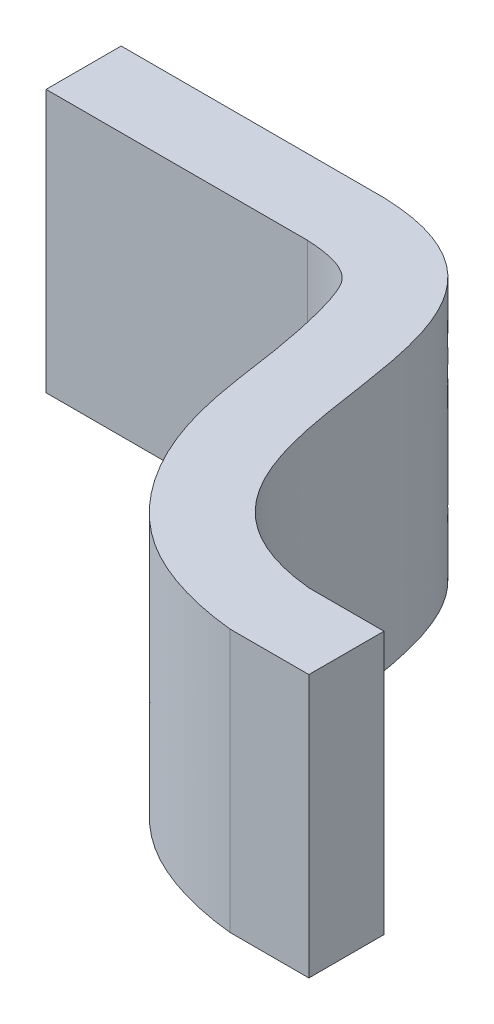
ISO-10303-21;
HEADER;
FILE_DESCRIPTION(('STEP AP214'),'2;1');
FILE_NAME('part.step','',(''),(''),'','','');
FILE_SCHEMA(('AUTOMOTIVE_DESIGN { 1 0 10303 214 1 1 1 1 }'));
ENDSEC;
DATA;
#1=APPLICATION_CONTEXT('core data for automotive mechanical design processes');
#2=APPLICATION_PROTOCOL_DEFINITION('international standard','automotive_design',2000,#1);
#3=PRODUCT_CONTEXT('',#1,'mechanical');
#4=PRODUCT('Part','Part','',(#3));
#5=PRODUCT_RELATED_PRODUCT_CATEGORY('part','',(#4));
#6=PRODUCT_DEFINITION_FORMATION('','',#4);
#7=PRODUCT_DEFINITION_CONTEXT('part definition',#1,'design');
#8=PRODUCT_DEFINITION('design','',#6,#7);
#9=PRODUCT_DEFINITION_SHAPE('','',#8);
#10=(LENGTH_UNIT() NAMED_UNIT(*) SI_UNIT(.MILLI.,.METRE.));
#11=(NAMED_UNIT(*) PLANE_ANGLE_UNIT() SI_UNIT($,.RADIAN.));
#12=(NAMED_UNIT(*) SI_UNIT($,.STERADIAN.) SOLID_ANGLE_UNIT());
#13=UNCERTAINTY_MEASURE_WITH_UNIT(LENGTH_MEASURE(1.E-05),#10,'distance_accuracy_value','');
#14=(GEOMETRIC_REPRESENTATION_CONTEXT(3) GLOBAL_UNCERTAINTY_ASSIGNED_CONTEXT((#13)) GLOBAL_UNIT_ASSIGNED_CONTEXT((#10,
#11,#12)) REPRESENTATION_CONTEXT('',''));
#15=CARTESIAN_POINT('',(0.,0.,0.));
#16=DIRECTION('',(0.,0.,1.));
#17=DIRECTION('',(1.,0.,0.));
#18=AXIS2_PLACEMENT_3D('',#15,#16,#17);
#19=CARTESIAN_POINT('',(0.381074398756027,0.523099170325608,1.2000000284124));
#20=DIRECTION('',(0.,-1.,-4.37113882867379E-08));
#21=DIRECTION('',(1.,0.,0.));
#22=AXIS2_PLACEMENT_3D('',#19,#20,#21);
#23=PLANE('',#22);
#24=CARTESIAN_POINT('',(-6.65392560124397,0.523099179067886,1.0000000284124));
#25=CARTESIAN_POINT('',(-6.6760213847098,0.52309917916311,0.997821538224355));
#26=CARTESIAN_POINT('',(-6.69813368756548,0.5230991793072,0.994525167165358));
#27=CARTESIAN_POINT('',(-6.74194760453987,0.523099179724687,0.984974174651608));
#28=CARTESIAN_POINT('',(-6.76364199343851,0.523099179999495,0.978687308291629));
#29=CARTESIAN_POINT('',(-6.8010868913745,0.523099180632001,0.964217236749238));
#30=CARTESIAN_POINT('',(-6.81710358266756,0.523099180958652,0.956744332526838));
#31=CARTESIAN_POINT('',(-6.84769864594612,0.523099181716968,0.939396085829369));
#32=CARTESIAN_POINT('',(-6.86228342605002,0.523099182148133,0.929532203397508));
#33=CARTESIAN_POINT('',(-6.88912475678651,0.523099183095543,0.907857995547797));
#34=CARTESIAN_POINT('',(-6.90144309560176,0.52309918360844,0.896124255535485));
#35=CARTESIAN_POINT('',(-6.92409093426443,0.523099184713152,0.870851377040496));
#36=CARTESIAN_POINT('',(-6.93441702178863,0.523099185305099,0.857309207032076));
#37=CARTESIAN_POINT('',(-6.96671116783855,0.523099187451881,0.808196568837449));
#38=CARTESIAN_POINT('',(-6.98363339651492,0.523099189149412,0.769361583704008));
#39=CARTESIAN_POINT('',(-7.00636675343762,0.52309919217834,0.700067795532774));
#40=CARTESIAN_POINT('',(-7.01392037587508,0.52309919349072,0.670044046614715));
#41=CARTESIAN_POINT('',(-7.02679822502435,0.523099196138999,0.609458466123203));
#42=CARTESIAN_POINT('',(-7.03211866901882,0.523099197474935,0.57889581220654));
#43=CARTESIAN_POINT('',(-7.04522373011164,0.523099201053773,0.497021526470976));
#44=CARTESIAN_POINT('',(-7.05225323067938,0.523099203301275,0.445604703624301));
#45=CARTESIAN_POINT('',(-7.06582589653957,0.523099206650856,0.368975220682632));
#46=CARTESIAN_POINT('',(-7.07085237182357,0.523099207763354,0.343524254211091));
#47=CARTESIAN_POINT('',(-7.08288891244714,0.523099209966576,0.293120376456015));
#48=CARTESIAN_POINT('',(-7.0898957194452,0.523099211057334,0.2681667185286));
#49=CARTESIAN_POINT('',(-7.10753002382366,0.523099213238403,0.218269668597796));
#50=CARTESIAN_POINT('',(-7.11829723428463,0.523099214326772,0.193370728858562));
#51=CARTESIAN_POINT('',(-7.13813270077437,0.523099215864952,0.158181288876764));
#52=CARTESIAN_POINT('',(-7.14532993400949,0.523099216360521,0.146843995173798));
#53=CARTESIAN_POINT('',(-7.16104748346313,0.523099217309469,0.125134581067309));
#54=CARTESIAN_POINT('',(-7.1695665343253,0.523099217762888,0.114761552617267));
#55=CARTESIAN_POINT('',(-7.19090199977994,0.523099218753559,0.0920976354280377));
#56=CARTESIAN_POINT('',(-7.20421803422598,0.523099219270646,0.0802680737363711));
#57=CARTESIAN_POINT('',(-7.23279289498044,0.523099220190851,0.0592162571948195));
#58=CARTESIAN_POINT('',(-7.24805496936829,0.523099220593773,0.0499984463761796));
#59=CARTESIAN_POINT('',(-7.28054440722777,0.523099221298688,0.033871863666304));
#60=CARTESIAN_POINT('',(-7.29782779482495,0.52309922159565,0.0270781840761291));
#61=CARTESIAN_POINT('',(-7.33319650573112,0.52309922208002,0.0159971017986491));
#62=CARTESIAN_POINT('',(-7.35128360657443,0.523099222267171,0.0117155856600657));
#63=CARTESIAN_POINT('',(-7.38352182929289,0.523099222518294,0.00597054024637886));
#64=CARTESIAN_POINT('',(-7.39760256337062,0.523099222600852,0.00408185602134143));
#65=CARTESIAN_POINT('',(-7.4257638425411,0.523099222721101,0.00133086562621593));
#66=CARTESIAN_POINT('',(-7.43984365839325,0.523099222759113,0.000461264208408363));
#67=CARTESIAN_POINT('',(-7.45392560124401,0.523099222779274,2.84124012060042E-08));
#68=B_SPLINE_CURVE_WITH_KNOTS('',3,(#24,#25,#26,#27,#28,#29,#30,#31,#32,#33,#34,#35,#36,#37,#38,
#39,#40,#41,#42,#43,#44,#45,#46,#47,#48,#49,#50,#51,#52,#53,#54,#55,#56,#57,#58,#59,#60,#61,#62,
#63,#64,#65,#66,#67),.UNSPECIFIED.,.F.,.F.,(4,2,2,2,2,2,2,2,2,2,2,2,2,2,2,2,2,2,2,2,2,4),(0.,
0.0667821137090893,0.134301214684031,0.187128508823994,0.239707439757743,0.290518731452934,
0.341416294675061,0.466712259088971,0.559563019654509,0.652570428897922,0.808245450373596,
0.886023921415196,0.963675157190788,1.04458784966541,1.08478909463837,1.12495209032638,
1.17807587168457,1.2312895104201,1.28677003517691,1.34238004906255,1.38496468867345,
1.42724258099923),.UNSPECIFIED.);
#69=CARTESIAN_POINT('',(-6.65392560124397,0.523099179067886,1.0000000284124));
#70=VERTEX_POINT('',#69);
#71=CARTESIAN_POINT('',(-7.45392560124397,0.523099222779274,2.84124023863797E-08));
#72=VERTEX_POINT('',#71);
#73=EDGE_CURVE('E11',#70,#72,#68,.T.);
#74=ORIENTED_EDGE('',*,*,#73,.F.);
#75=DIRECTION('',(-1.,0.,0.));
#76=VECTOR('',#75,1.);
#77=CARTESIAN_POINT('',(-6.45392560124397,0.523099179067886,1.0000000284124));
#78=LINE('',#77,#76);
#79=CARTESIAN_POINT('',(-6.45392560124397,0.523099179067886,1.0000000284124));
#80=VERTEX_POINT('',#79);
#81=EDGE_CURVE('E179',#80,#70,#78,.T.);
#82=ORIENTED_EDGE('',*,*,#81,.F.);
#83=DIRECTION('',(0.,4.37113883977602E-08,-0.999999999999999));
#84=VECTOR('',#83,1.);
#85=CARTESIAN_POINT('',(-6.45392560124397,0.523099170325608,1.2000000284124));
#86=LINE('',#85,#84);
#87=CARTESIAN_POINT('',(-6.45392560124397,0.523099170325608,1.2000000284124));
#88=VERTEX_POINT('',#87);
#89=EDGE_CURVE('E155',#88,#80,#86,.T.);
#90=ORIENTED_EDGE('',*,*,#89,.F.);
#91=DIRECTION('',(-1.,0.,0.));
#92=VECTOR('',#91,1.);
#93=CARTESIAN_POINT('',(-6.45392560124397,0.523099170325608,1.2000000284124));
#94=LINE('',#93,#92);
#95=CARTESIAN_POINT('',(-6.66372477809197,0.523099170325608,1.2000000284124));
#96=VERTEX_POINT('',#95);
#97=EDGE_CURVE('E148',#88,#96,#94,.T.);
#98=ORIENTED_EDGE('',*,*,#97,.T.);
#99=CARTESIAN_POINT('',(-6.66372477809197,0.523099170325608,1.2000000284124));
#100=CARTESIAN_POINT('',(-6.68235816480651,0.523099170406118,1.19815817509081));
#101=CARTESIAN_POINT('',(-6.70093498946342,0.523099170513507,1.19570139866285));
#102=CARTESIAN_POINT('',(-6.73791221278168,0.52309917078471,1.18949699907566));
#103=CARTESIAN_POINT('',(-6.75631214417819,0.523099170948645,1.1857466015809));
#104=CARTESIAN_POINT('',(-6.79295513620438,0.52309917133702,1.17686162524785));
#105=CARTESIAN_POINT('',(-6.8111952940445,0.523099171561991,1.17171489105382));
#106=CARTESIAN_POINT('',(-6.84717172345389,0.52309917207712,1.15993009834338));
#107=CARTESIAN_POINT('',(-6.86490837899947,0.523099172367228,1.15329321263317));
#108=CARTESIAN_POINT('',(-6.90549462665057,0.523099173130766,1.13582549945528));
#109=CARTESIAN_POINT('',(-6.92807290255751,0.523099173633063,1.12433429434548));
#110=CARTESIAN_POINT('',(-6.97096829666688,0.523099174789194,1.0978850742192));
#111=CARTESIAN_POINT('',(-6.9912955036889,0.523099175442309,1.082943537511));
#112=CARTESIAN_POINT('',(-7.02796037846709,0.523099176815502,1.05152854045932));
#113=CARTESIAN_POINT('',(-7.04448684621663,0.523099177526106,1.03527184444206));
#114=CARTESIAN_POINT('',(-7.0754212602201,0.523099179033289,1.00079152577337));
#115=CARTESIAN_POINT('',(-7.08982362168071,0.523099179830086,0.982562928971802));
#116=CARTESIAN_POINT('',(-7.11808537102814,0.52309918158959,0.942310147448806));
#117=CARTESIAN_POINT('',(-7.1316696505039,0.523099182560717,0.920093360969633));
#118=CARTESIAN_POINT('',(-7.15605550233222,0.523099184565506,0.874229145825882));
#119=CARTESIAN_POINT('',(-7.16686079670802,0.523099185599082,0.850583683658809));
#120=CARTESIAN_POINT('',(-7.18656671922941,0.523099187799275,0.800249155192402));
#121=CARTESIAN_POINT('',(-7.19523524065514,0.523099188969817,0.773470263913924));
#122=CARTESIAN_POINT('',(-7.20995546192352,0.523099191342175,0.719197008038475));
#123=CARTESIAN_POINT('',(-7.21600397870321,0.523099192544028,0.691701815934891));
#124=CARTESIAN_POINT('',(-7.22444466903982,0.523099194510307,0.646718611183905));
#125=CARTESIAN_POINT('',(-7.22735928328766,0.52309919527076,0.629321471969463));
#126=CARTESIAN_POINT('',(-7.23280873084802,0.523099196794382,0.594465063705472));
#127=CARTESIAN_POINT('',(-7.235343477908,0.523099197557551,0.577005781464265));
#128=CARTESIAN_POINT('',(-7.24043139259136,0.523099199083645,0.542092834268316));
#129=CARTESIAN_POINT('',(-7.24298455656837,0.523099199846569,0.524639168879595));
#130=CARTESIAN_POINT('',(-7.24852784389109,0.523099201369191,0.489805623245772));
#131=CARTESIAN_POINT('',(-7.25151784908981,0.52309920212889,0.472425724353722));
#132=CARTESIAN_POINT('',(-7.2593930344497,0.523099203982638,0.430016914878112));
#133=CARTESIAN_POINT('',(-7.26452884999095,0.523099205074757,0.405032186661607));
#134=CARTESIAN_POINT('',(-7.27334542318719,0.523099206701662,0.367812909831134));
#135=CARTESIAN_POINT('',(-7.27647049737492,0.523099207242192,0.355446989187103));
#136=CARTESIAN_POINT('',(-7.28323298853228,0.52309920831701,0.330858098256283));
#137=CARTESIAN_POINT('',(-7.28687011761276,0.523099208851302,0.318635051795952));
#138=CARTESIAN_POINT('',(-7.29334407740757,0.523099209693244,0.299373396061492));
#139=CARTESIAN_POINT('',(-7.2959066269859,0.523099210004872,0.292243982290239));
#140=CARTESIAN_POINT('',(-7.30148473904446,0.523099210620009,0.278171894198803));
#141=CARTESIAN_POINT('',(-7.30449961539945,0.523099210923528,0.27122895550911));
#142=CARTESIAN_POINT('',(-7.31076754414832,0.52309921145799,0.258999943257013));
#143=CARTESIAN_POINT('',(-7.31387365469767,0.523099211691979,0.253644766573164));
#144=CARTESIAN_POINT('',(-7.32080381678023,0.523099212099995,0.244316025576674));
#145=CARTESIAN_POINT('',(-7.32450000384901,0.523099212277838,0.240254004796936));
#146=CARTESIAN_POINT('',(-7.33394897363332,0.523099212634285,0.232075994627863));
#147=CARTESIAN_POINT('',(-7.33998642044214,0.523099212797349,0.22830408040006));
#148=CARTESIAN_POINT('',(-7.34920308092036,0.523099213026277,0.223113120130131));
#149=CARTESIAN_POINT('',(-7.35228960650534,0.523099213099717,0.221466188737754));
#150=CARTESIAN_POINT('',(-7.35857989092758,0.523099213230914,0.218417400174966));
#151=CARTESIAN_POINT('',(-7.36178332741555,0.523099213288711,0.217014922844269));
#152=CARTESIAN_POINT('',(-7.37090352258754,0.52309921343868,0.213465070828703));
#153=CARTESIAN_POINT('',(-7.37693693346537,0.52309921352127,0.211621727693837));
#154=CARTESIAN_POINT('',(-7.38670569686491,0.523099213634643,0.209137235761761));
#155=CARTESIAN_POINT('',(-7.39039887638499,0.523099213672957,0.208309721491273));
#156=CARTESIAN_POINT('',(-7.39781445722382,0.523099213740585,0.20679968656988));
#157=CARTESIAN_POINT('',(-7.40153685423347,0.5230992137699,0.206117144939588));
#158=CARTESIAN_POINT('',(-7.41389968086125,0.523099213860073,0.204032104639086));
#159=CARTESIAN_POINT('',(-7.42257948480063,0.523099213911798,0.202861138742713));
#160=CARTESIAN_POINT('',(-7.43563044947402,0.52309921397252,0.201476623687637));
#161=CARTESIAN_POINT('',(-7.43998307619468,0.523099213989943,0.201077249866301));
#162=CARTESIAN_POINT('',(-7.44869872182374,0.523099214018429,0.200424019159067));
#163=CARTESIAN_POINT('',(-7.45306173976726,0.523099214029493,0.200170149253583));
#164=CARTESIAN_POINT('',(-7.45742938297997,0.523099214036996,0.200000028412402));
#165=B_SPLINE_CURVE_WITH_KNOTS('',3,(#99,#100,#101,#102,#103,#104,#105,#106,#107,#108,#109,#110,
#111,#112,#113,#114,#115,#116,#117,#118,#119,#120,#121,#122,#123,#124,#125,#126,#127,#128,#129,
#130,#131,#132,#133,#134,#135,#136,#137,#138,#139,#140,#141,#142,#143,#144,#145,#146,#147,#148,
#149,#150,#151,#152,#153,#154,#155,#156,#157,#158,#159,#160,#161,#162,#163,#164),.UNSPECIFIED.,
.F.,.F.,(4,2,2,2,2,2,2,2,2,2,2,2,2,2,2,2,2,2,2,2,2,2,2,2,2,2,2,2,2,2,2,2,4),(0.,
0.0561681589095711,0.112457534383139,0.169253578612371,0.226005077906886,0.301715004036545,
0.377070566346002,0.446424912055152,0.515958475234816,0.593880428548584,0.671697467408243,
0.755964517163008,0.840333658382208,0.893247792631838,0.946173923407371,0.999089848164162,
1.05199148781442,1.12847716172405,1.16673541076623,1.20497223539784,1.22769072756634,
1.25037510056687,1.26886797593494,1.28517999290264,1.30634908955327,1.31685139211729,
1.32732665061524,1.34619861049414,1.35755137220421,1.36890248990409,1.39515927363249,
1.40827024085607,1.42138003473644),.UNSPECIFIED.);
#166=CARTESIAN_POINT('',(-7.45742938297997,0.523099214036996,0.200000028412402));
#167=VERTEX_POINT('',#166);
#168=EDGE_CURVE('E196',#96,#167,#165,.T.);
#169=ORIENTED_EDGE('',*,*,#168,.T.);
#170=DIRECTION('',(1.,0.,0.));
#171=VECTOR('',#170,1.);
#172=CARTESIAN_POINT('',(-8.15392560124397,0.523099214036996,0.200000028412401));
#173=LINE('',#172,#171);
#174=CARTESIAN_POINT('',(-8.15392560124397,0.523099214036996,0.200000028412402));
#175=VERTEX_POINT('',#174);
#176=EDGE_CURVE('E102',#175,#167,#173,.T.);
#177=ORIENTED_EDGE('',*,*,#176,.F.);
#178=DIRECTION('',(0.,4.37113883977602E-08,-0.999999999999999));
#179=VECTOR('',#178,1.);
#180=CARTESIAN_POINT('',(-8.15392560124397,0.523099214036996,0.200000028412402));
#181=LINE('',#180,#179);
#182=CARTESIAN_POINT('',(-8.15392560124397,0.523099222779274,2.84124023863797E-08));
#183=VERTEX_POINT('',#182);
#184=EDGE_CURVE('E90',#175,#183,#181,.T.);
#185=ORIENTED_EDGE('',*,*,#184,.T.);
#186=DIRECTION('',(-1.,0.,0.));
#187=VECTOR('',#186,1.);
#188=CARTESIAN_POINT('',(-7.45392560124397,0.523099222779274,2.84124023863797E-08));
#189=LINE('',#188,#187);
#190=EDGE_CURVE('E100',#72,#183,#189,.T.);
#191=ORIENTED_EDGE('',*,*,#190,.F.);
#192=EDGE_LOOP('',(#74,#82,#90,#98,#169,#177,#185,#191));
#193=FACE_BOUND('',#192,.T.);
#194=ADVANCED_FACE('F17',(#193),#23,.T.);
#195=CARTESIAN_POINT('',(0.381074398756027,1.22309917032561,1.20000005901037));
#196=DIRECTION('',(0.,-1.,-4.37113882867379E-08));
#197=DIRECTION('',(1.,0.,0.));
#198=AXIS2_PLACEMENT_3D('',#195,#196,#197);
#199=PLANE('',#198);
#200=DIRECTION('',(-1.,0.,0.));
#201=VECTOR('',#200,1.);
#202=CARTESIAN_POINT('',(-6.45392560124397,1.22309917906789,1.00000005901037));
#203=LINE('',#202,#201);
#204=CARTESIAN_POINT('',(-6.45392560124397,1.22309917906789,1.00000005901037));
#205=VERTEX_POINT('',#204);
#206=CARTESIAN_POINT('',(-6.65392560124397,1.22309917906789,1.00000005901037));
#207=VERTEX_POINT('',#206);
#208=EDGE_CURVE('E30',#205,#207,#203,.T.);
#209=ORIENTED_EDGE('',*,*,#208,.T.);
#210=CARTESIAN_POINT('',(-6.65392560124397,1.22309917906788,1.00000005901037));
#211=CARTESIAN_POINT('',(-6.6760213847098,1.22309917916311,0.997821568822326));
#212=CARTESIAN_POINT('',(-6.69813368756548,1.2230991793072,0.994525197763329));
#213=CARTESIAN_POINT('',(-6.74194760453987,1.22309917972468,0.984974205249579));
#214=CARTESIAN_POINT('',(-6.76364199343851,1.22309917999949,0.978687338889601));
#215=CARTESIAN_POINT('',(-6.8010868913745,1.223099180632,0.964217267347209));
#216=CARTESIAN_POINT('',(-6.81710358266756,1.22309918095865,0.956744363124808));
#217=CARTESIAN_POINT('',(-6.84769864594612,1.22309918171697,0.939396116427339));
#218=CARTESIAN_POINT('',(-6.86228342605002,1.22309918214814,0.929532233995479));
#219=CARTESIAN_POINT('',(-6.88912475678651,1.22309918309555,0.907858026145769));
#220=CARTESIAN_POINT('',(-6.90144309560176,1.22309918360844,0.896124286133457));
#221=CARTESIAN_POINT('',(-6.92409093426443,1.22309918471315,0.870851407638468));
#222=CARTESIAN_POINT('',(-6.93441702178863,1.2230991853051,0.857309237630048));
#223=CARTESIAN_POINT('',(-6.96671116783855,1.22309918745189,0.808196599435421));
#224=CARTESIAN_POINT('',(-6.98363339651492,1.22309918914941,0.769361614301979));
#225=CARTESIAN_POINT('',(-7.00636675343762,1.22309919217834,0.700067826130745));
#226=CARTESIAN_POINT('',(-7.01392037587509,1.22309919349072,0.670044077212686));
#227=CARTESIAN_POINT('',(-7.02679822502435,1.223099196139,0.609458496721175));
#228=CARTESIAN_POINT('',(-7.03211866901882,1.22309919747493,0.578895842804511));
#229=CARTESIAN_POINT('',(-7.04522373011164,1.22309920105377,0.497021557068948));
#230=CARTESIAN_POINT('',(-7.05225323067938,1.22309920330127,0.445604734222273));
#231=CARTESIAN_POINT('',(-7.06582589653957,1.22309920665086,0.368975251280605));
#232=CARTESIAN_POINT('',(-7.07085237182357,1.22309920776335,0.343524284809063));
#233=CARTESIAN_POINT('',(-7.08288891244714,1.22309920996658,0.293120407053988));
#234=CARTESIAN_POINT('',(-7.0898957194452,1.22309921105734,0.268166749126573));
#235=CARTESIAN_POINT('',(-7.10753002382366,1.22309921323841,0.218269699195768));
#236=CARTESIAN_POINT('',(-7.11829723428462,1.22309921432677,0.193370759456532));
#237=CARTESIAN_POINT('',(-7.13813270077437,1.22309921586495,0.158181319474735));
#238=CARTESIAN_POINT('',(-7.14532993400949,1.22309921636052,0.146844025771769));
#239=CARTESIAN_POINT('',(-7.16104748346313,1.22309921730947,0.125134611665281));
#240=CARTESIAN_POINT('',(-7.1695665343253,1.22309921776288,0.114761583215239));
#241=CARTESIAN_POINT('',(-7.19090199977994,1.22309921875355,0.0920976660260085));
#242=CARTESIAN_POINT('',(-7.20421803422598,1.22309921927065,0.0802681043343424));
#243=CARTESIAN_POINT('',(-7.23279289498045,1.22309922019085,0.0592162877927914));
#244=CARTESIAN_POINT('',(-7.24805496936829,1.22309922059377,0.0499984769741516));
#245=CARTESIAN_POINT('',(-7.28054440722777,1.22309922129869,0.0338718942642754));
#246=CARTESIAN_POINT('',(-7.29782779482495,1.22309922159565,0.0270782146741003));
#247=CARTESIAN_POINT('',(-7.33319650573112,1.22309922208002,0.0159971323966204));
#248=CARTESIAN_POINT('',(-7.35128360657443,1.22309922226717,0.0117156162580375));
#249=CARTESIAN_POINT('',(-7.38352182929289,1.2230992225183,0.00597057084435083));
#250=CARTESIAN_POINT('',(-7.39760256337062,1.22309922260085,0.00408188661931331));
#251=CARTESIAN_POINT('',(-7.4257638425411,1.2230992227211,0.00133089622418765));
#252=CARTESIAN_POINT('',(-7.43984365839325,1.22309922275911,0.000461294806380006));
#253=CARTESIAN_POINT('',(-7.45392560124401,1.22309922277927,5.90103729623118E-08));
#254=B_SPLINE_CURVE_WITH_KNOTS('',3,(#210,#211,#212,#213,#214,#215,#216,#217,#218,#219,#220,
#221,#222,#223,#224,#225,#226,#227,#228,#229,#230,#231,#232,#233,#234,#235,#236,#237,#238,#239,
#240,#241,#242,#243,#244,#245,#246,#247,#248,#249,#250,#251,#252,#253),.UNSPECIFIED.,.F.,.F.,(4,
2,2,2,2,2,2,2,2,2,2,2,2,2,2,2,2,2,2,2,2,4),(0.,0.0667821137090891,0.134301214684031,
0.187128508823994,0.239707439757742,0.290518731452933,0.34141629467506,0.466712259088971,
0.559563019654509,0.652570428897922,0.808245450373596,0.886023921415195,0.963675157190788,
1.04458784966541,1.08478909463837,1.12495209032638,1.17807587168457,1.2312895104201,
1.28677003517691,1.34238004906255,1.38496468867345,1.42724258099923),.UNSPECIFIED.);
#255=CARTESIAN_POINT('',(-7.45392560124397,1.22309922277927,5.90103741870962E-08));
#256=VERTEX_POINT('',#255);
#257=EDGE_CURVE('E158',#207,#256,#254,.T.);
#258=ORIENTED_EDGE('',*,*,#257,.T.);
#259=DIRECTION('',(-1.,0.,0.));
#260=VECTOR('',#259,1.);
#261=CARTESIAN_POINT('',(-7.45392560124397,1.22309922277927,5.90103741870962E-08));
#262=LINE('',#261,#260);
#263=CARTESIAN_POINT('',(-8.15392560124397,1.22309922277927,5.90103741870962E-08));
#264=VERTEX_POINT('',#263);
#265=EDGE_CURVE('E151',#256,#264,#262,.T.);
#266=ORIENTED_EDGE('',*,*,#265,.T.);
#267=DIRECTION('',(0.,4.37113878426487E-08,-0.999999999999999));
#268=VECTOR('',#267,1.);
#269=CARTESIAN_POINT('',(-8.15392560124397,1.223099214037,0.200000059010374));
#270=LINE('',#269,#268);
#271=CARTESIAN_POINT('',(-8.15392560124397,1.223099214037,0.200000059010374));
#272=VERTEX_POINT('',#271);
#273=EDGE_CURVE('E93',#272,#264,#270,.T.);
#274=ORIENTED_EDGE('',*,*,#273,.F.);
#275=DIRECTION('',(1.,0.,0.));
#276=VECTOR('',#275,1.);
#277=CARTESIAN_POINT('',(-8.15392560124397,1.22309921403699,0.200000059010372));
#278=LINE('',#277,#276);
#279=CARTESIAN_POINT('',(-7.45742938297997,1.223099214037,0.200000059010374));
#280=VERTEX_POINT('',#279);
#281=EDGE_CURVE('E193',#272,#280,#278,.T.);
#282=ORIENTED_EDGE('',*,*,#281,.T.);
#283=CARTESIAN_POINT('',(-6.66372477809197,1.22309917032561,1.20000005901037));
#284=CARTESIAN_POINT('',(-6.68235816480651,1.22309917040612,1.19815820568879));
#285=CARTESIAN_POINT('',(-6.70093498946342,1.22309917051351,1.19570142926083));
#286=CARTESIAN_POINT('',(-6.73791221278168,1.22309917078471,1.18949702967363));
#287=CARTESIAN_POINT('',(-6.75631214417819,1.22309917094865,1.18574663217888));
#288=CARTESIAN_POINT('',(-6.79295513620438,1.22309917133702,1.17686165584582));
#289=CARTESIAN_POINT('',(-6.8111952940445,1.22309917156199,1.17171492165179));
#290=CARTESIAN_POINT('',(-6.84717172345389,1.22309917207712,1.15993012894135));
#291=CARTESIAN_POINT('',(-6.86490837899947,1.22309917236723,1.15329324323115));
#292=CARTESIAN_POINT('',(-6.90549462665057,1.22309917313077,1.13582553005325));
#293=CARTESIAN_POINT('',(-6.92807290255751,1.22309917363306,1.12433432494345));
#294=CARTESIAN_POINT('',(-6.97096829666688,1.22309917478919,1.09788510481717));
#295=CARTESIAN_POINT('',(-6.9912955036889,1.22309917544231,1.08294356810896));
#296=CARTESIAN_POINT('',(-7.02796037846709,1.2230991768155,1.05152857105729));
#297=CARTESIAN_POINT('',(-7.04448684621663,1.22309917752611,1.03527187504003));
#298=CARTESIAN_POINT('',(-7.0754212602201,1.22309917903329,1.00079155637134));
#299=CARTESIAN_POINT('',(-7.08982362168071,1.22309917983008,0.982562959569773));
#300=CARTESIAN_POINT('',(-7.11808537102814,1.22309918158959,0.942310178046778));
#301=CARTESIAN_POINT('',(-7.1316696505039,1.22309918256072,0.920093391567605));
#302=CARTESIAN_POINT('',(-7.15605550233222,1.22309918456551,0.874229176423855));
#303=CARTESIAN_POINT('',(-7.16686079670802,1.22309918559908,0.850583714256781));
#304=CARTESIAN_POINT('',(-7.18656671922941,1.22309918779927,0.800249185790373));
#305=CARTESIAN_POINT('',(-7.19523524065515,1.22309918896982,0.773470294511897));
#306=CARTESIAN_POINT('',(-7.20995546192352,1.22309919134218,0.719197038636447));
#307=CARTESIAN_POINT('',(-7.21600397870321,1.22309919254403,0.691701846532862));
#308=CARTESIAN_POINT('',(-7.22444466903982,1.22309919451031,0.646718641781876));
#309=CARTESIAN_POINT('',(-7.22735928328766,1.22309919527076,0.629321502567434));
#310=CARTESIAN_POINT('',(-7.23280873084802,1.22309919679438,0.594465094303443));
#311=CARTESIAN_POINT('',(-7.23534347790799,1.22309919755755,0.577005812062236));
#312=CARTESIAN_POINT('',(-7.24043139259136,1.22309919908364,0.542092864866288));
#313=CARTESIAN_POINT('',(-7.24298455656837,1.22309919984657,0.524639199477567));
#314=CARTESIAN_POINT('',(-7.24852784389109,1.22309920136919,0.489805653843744));
#315=CARTESIAN_POINT('',(-7.25151784908981,1.22309920212889,0.472425754951693));
#316=CARTESIAN_POINT('',(-7.2593930344497,1.22309920398264,0.430016945476084));
#317=CARTESIAN_POINT('',(-7.26452884999095,1.22309920507476,0.40503221725958));
#318=CARTESIAN_POINT('',(-7.27334542318719,1.22309920670166,0.367812940429106));
#319=CARTESIAN_POINT('',(-7.27647049737491,1.22309920724219,0.355447019785074));
#320=CARTESIAN_POINT('',(-7.28323298853228,1.22309920831701,0.330858128854254));
#321=CARTESIAN_POINT('',(-7.28687011761276,1.22309920885131,0.318635082393924));
#322=CARTESIAN_POINT('',(-7.29334407740757,1.22309920969324,0.299373426659464));
#323=CARTESIAN_POINT('',(-7.2959066269859,1.22309921000486,0.292244012888212));
#324=CARTESIAN_POINT('',(-7.30148473904446,1.22309921062002,0.278171924796775));
#325=CARTESIAN_POINT('',(-7.30449961539945,1.22309921092356,0.271228986107083));
#326=CARTESIAN_POINT('',(-7.31076754414832,1.22309921145796,0.258999973854985));
#327=CARTESIAN_POINT('',(-7.31387365469767,1.22309921169188,0.253644797171136));
#328=CARTESIAN_POINT('',(-7.32080381678023,1.22309921210008,0.244316056174645));
#329=CARTESIAN_POINT('',(-7.32450000384901,1.22309921227814,0.240254035394907));
#330=CARTESIAN_POINT('',(-7.33394897363332,1.22309921263381,0.232076025225834));
#331=CARTESIAN_POINT('',(-7.33998642044214,1.2230992127955,0.228304110998031));
#332=CARTESIAN_POINT('',(-7.34920308092036,1.22309921302596,0.223113150728103));
#333=CARTESIAN_POINT('',(-7.35228960650534,1.2230992131005,0.221466219335726));
#334=CARTESIAN_POINT('',(-7.35857989092758,1.22309921323013,0.218417430772938));
#335=CARTESIAN_POINT('',(-7.36178332741555,1.22309921328527,0.21701495344224));
#336=CARTESIAN_POINT('',(-7.37090352258754,1.22309921343131,0.213465101426675));
#337=CARTESIAN_POINT('',(-7.37693693346537,1.22309921351543,0.211621758291809));
#338=CARTESIAN_POINT('',(-7.38670569686491,1.22309921363241,0.209137266359733));
#339=CARTESIAN_POINT('',(-7.39039887638499,1.22309921367234,0.208309752089245));
#340=CARTESIAN_POINT('',(-7.39781445722382,1.2230992137412,0.206799717167852));
#341=CARTESIAN_POINT('',(-7.40153685423347,1.22309921377012,0.20611717553756));
#342=CARTESIAN_POINT('',(-7.41389968086125,1.22309921385957,0.204032135237058));
#343=CARTESIAN_POINT('',(-7.42257948480063,1.2230992139117,0.202861169340685));
#344=CARTESIAN_POINT('',(-7.43563044947402,1.22309921397257,0.201476654285609));
#345=CARTESIAN_POINT('',(-7.43998307619468,1.22309921398997,0.201077280464273));
#346=CARTESIAN_POINT('',(-7.44869872182374,1.2230992140184,0.200424049757039));
#347=CARTESIAN_POINT('',(-7.45306173976726,1.22309921402944,0.200170179851555));
#348=CARTESIAN_POINT('',(-7.45742938297997,1.223099214037,0.200000059010374));
#349=B_SPLINE_CURVE_WITH_KNOTS('',3,(#283,#284,#285,#286,#287,#288,#289,#290,#291,#292,#293,
#294,#295,#296,#297,#298,#299,#300,#301,#302,#303,#304,#305,#306,#307,#308,#309,#310,#311,#312,
#313,#314,#315,#316,#317,#318,#319,#320,#321,#322,#323,#324,#325,#326,#327,#328,#329,#330,#331,
#332,#333,#334,#335,#336,#337,#338,#339,#340,#341,#342,#343,#344,#345,#346,#347,#348),
.UNSPECIFIED.,.F.,.F.,(4,2,2,2,2,2,2,2,2,2,2,2,2,2,2,2,2,2,2,2,2,2,2,2,2,2,2,2,2,2,2,2,4),(0.,
0.0561681589095717,0.112457534383139,0.169253578612371,0.226005077906887,0.301715004036545,
0.377070566346003,0.446424912055152,0.515958475234815,0.593880428548583,0.671697467408243,
0.755964517163008,0.840333658382208,0.893247792631839,0.946173923407371,0.999089848164162,
1.05199148781442,1.12847716172405,1.16673541076623,1.20497223539784,1.22769072756634,
1.25037510056687,1.26886797593494,1.28517999290264,1.30634908955327,1.31685139211729,
1.32732665061524,1.34619861049414,1.35755137220421,1.36890248990409,1.39515927363249,
1.40827024085607,1.42138003473644),.UNSPECIFIED.);
#350=CARTESIAN_POINT('',(-6.66372477809197,1.22309917032561,1.20000005901037));
#351=VERTEX_POINT('',#350);
#352=EDGE_CURVE('E98',#351,#280,#349,.T.);
#353=ORIENTED_EDGE('',*,*,#352,.F.);
#354=DIRECTION('',(-1.,0.,0.));
#355=VECTOR('',#354,1.);
#356=CARTESIAN_POINT('',(-6.45392560124397,1.22309917032561,1.20000005901037));
#357=LINE('',#356,#355);
#358=CARTESIAN_POINT('',(-6.45392560124397,1.22309917032561,1.20000005901037));
#359=VERTEX_POINT('',#358);
#360=EDGE_CURVE('E164',#359,#351,#357,.T.);
#361=ORIENTED_EDGE('',*,*,#360,.F.);
#362=DIRECTION('',(0.,4.37113878426487E-08,-0.999999999999999));
#363=VECTOR('',#362,1.);
#364=CARTESIAN_POINT('',(-6.45392560124397,1.22309917032561,1.20000005901037));
#365=LINE('',#364,#363);
#366=EDGE_CURVE('E197',#359,#205,#365,.T.);
#367=ORIENTED_EDGE('',*,*,#366,.T.);
#368=EDGE_LOOP('',(#209,#258,#266,#274,#282,#353,#361,#367));
#369=FACE_BOUND('',#368,.T.);
#370=ADVANCED_FACE('F121',(#369),#199,.F.);
#371=CARTESIAN_POINT('',(0.381074398756027,-0.126900829674392,1.2));
#372=DIRECTION('',(0.,-4.37113882867379E-08,1.));
#373=DIRECTION('',(0.,-1.,-4.37113882867379E-08));
#374=AXIS2_PLACEMENT_3D('',#371,#372,#373);
#375=PLANE('',#374);
#376=ORIENTED_EDGE('',*,*,#360,.T.);
#377=DIRECTION('',(0.,-0.999999999999999,-4.37113881598552E-08));
#378=VECTOR('',#377,1.);
#379=CARTESIAN_POINT('',(-6.66372477809198,1.22309917032561,1.20000005901037));
#380=LINE('',#379,#378);
#381=EDGE_CURVE('E153',#351,#96,#380,.T.);
#382=ORIENTED_EDGE('',*,*,#381,.T.);
#383=ORIENTED_EDGE('',*,*,#97,.F.);
#384=DIRECTION('',(0.,0.999999999999999,4.37113881598552E-08));
#385=VECTOR('',#384,1.);
#386=CARTESIAN_POINT('',(-6.45392560124397,0.523099170325608,1.2000000284124));
#387=LINE('',#386,#385);
#388=EDGE_CURVE('E191',#88,#359,#387,.T.);
#389=ORIENTED_EDGE('',*,*,#388,.T.);
#390=EDGE_LOOP('',(#376,#382,#383,#389));
#391=FACE_BOUND('',#390,.T.);
#392=ADVANCED_FACE('F172',(#391),#375,.T.);
#393=CARTESIAN_POINT('',(-6.45392560124397,-0.126900829674392,1.2));
#394=DIRECTION('',(-1.,0.,0.));
#395=DIRECTION('',(0.,-1.,-4.37113882867379E-08));
#396=AXIS2_PLACEMENT_3D('',#393,#394,#395);
#397=PLANE('',#396);
#398=ORIENTED_EDGE('',*,*,#89,.T.);
#399=DIRECTION('',(0.,-0.999999999999999,-4.37113881598552E-08));
#400=VECTOR('',#399,1.);
#401=CARTESIAN_POINT('',(-6.45392560124397,1.22309917906789,1.00000005901037));
#402=LINE('',#401,#400);
#403=EDGE_CURVE('E140',#205,#80,#402,.T.);
#404=ORIENTED_EDGE('',*,*,#403,.F.);
#405=ORIENTED_EDGE('',*,*,#366,.F.);
#406=ORIENTED_EDGE('',*,*,#388,.F.);
#407=EDGE_LOOP('',(#398,#404,#405,#406));
#408=FACE_BOUND('',#407,.T.);
#409=ADVANCED_FACE('F209',(#408),#397,.F.);
#410=CARTESIAN_POINT('',(-8.15392560124397,-0.126900829674392,1.2));
#411=DIRECTION('',(-1.,0.,0.));
#412=DIRECTION('',(0.,-1.,-4.37113882867379E-08));
#413=AXIS2_PLACEMENT_3D('',#410,#411,#412);
#414=PLANE('',#413);
#415=DIRECTION('',(0.,-0.999999999999999,-4.37113881598552E-08));
#416=VECTOR('',#415,1.);
#417=CARTESIAN_POINT('',(-8.15392560124397,1.223099214037,0.200000059010374));
#418=LINE('',#417,#416);
#419=EDGE_CURVE('E146',#272,#175,#418,.T.);
#420=ORIENTED_EDGE('',*,*,#419,.F.);
#421=ORIENTED_EDGE('',*,*,#273,.T.);
#422=DIRECTION('',(0.,0.999999999999999,4.37113882867379E-08));
#423=VECTOR('',#422,1.);
#424=CARTESIAN_POINT('',(-8.15392560124397,0.523099222779274,2.84124023863797E-08));
#425=LINE('',#424,#423);
#426=EDGE_CURVE('E87',#183,#264,#425,.T.);
#427=ORIENTED_EDGE('',*,*,#426,.F.);
#428=ORIENTED_EDGE('',*,*,#184,.F.);
#429=EDGE_LOOP('',(#420,#421,#427,#428));
#430=FACE_BOUND('',#429,.T.);
#431=ADVANCED_FACE('F89',(#430),#414,.T.);
#432=CARTESIAN_POINT('',(0.381074398756027,-0.126900777220726,0.));
#433=DIRECTION('',(0.,-4.37113882867379E-08,1.));
#434=DIRECTION('',(0.,-1.,-4.37113882867379E-08));
#435=AXIS2_PLACEMENT_3D('',#432,#433,#434);
#436=PLANE('',#435);
#437=ORIENTED_EDGE('',*,*,#265,.F.);
#438=DIRECTION('',(0.,-0.999999999999999,-4.37113882867379E-08));
#439=VECTOR('',#438,1.);
#440=CARTESIAN_POINT('',(-7.45392560124397,1.22309922277927,5.90103741870962E-08));
#441=LINE('',#440,#439);
#442=EDGE_CURVE('E97',#256,#72,#441,.T.);
#443=ORIENTED_EDGE('',*,*,#442,.T.);
#444=ORIENTED_EDGE('',*,*,#190,.T.);
#445=ORIENTED_EDGE('',*,*,#426,.T.);
#446=EDGE_LOOP('',(#437,#443,#444,#445));
#447=FACE_BOUND('',#446,.T.);
#448=ADVANCED_FACE('F105',(#447),#436,.F.);
#449=CARTESIAN_POINT('',(0.381074398756027,5.01772964056189,1.00000022487894));
#450=DIRECTION('',(0.,-4.37113882867379E-08,1.));
#451=DIRECTION('',(0.,-1.,-4.37113882867379E-08));
#452=AXIS2_PLACEMENT_3D('',#449,#450,#451);
#453=PLANE('',#452);
#454=ORIENTED_EDGE('',*,*,#81,.T.);
#455=DIRECTION('',(0.,-0.999999999999999,-4.37113881598552E-08));
#456=VECTOR('',#455,1.);
#457=CARTESIAN_POINT('',(-6.65392560124397,1.22309917906789,1.00000005901037));
#458=LINE('',#457,#456);
#459=EDGE_CURVE('E103',#207,#70,#458,.T.);
#460=ORIENTED_EDGE('',*,*,#459,.F.);
#461=ORIENTED_EDGE('',*,*,#208,.F.);
#462=ORIENTED_EDGE('',*,*,#403,.T.);
#463=EDGE_LOOP('',(#454,#460,#461,#462));
#464=FACE_BOUND('',#463,.T.);
#465=ADVANCED_FACE('F170',(#464),#453,.F.);
#466=CARTESIAN_POINT('',(-6.65392560124397,5.01772964056189,1.00000022487894));
#467=CARTESIAN_POINT('',(-7.29924299938797,5.01772964333266,0.93661226287194));
#468=CARTESIAN_POINT('',(-6.78982889187097,5.01772968333384,0.0214920441178097));
#469=CARTESIAN_POINT('',(-7.45392560124397,5.01772968427327,2.24878939694144E-07));
#470=B_SPLINE_CURVE_WITH_KNOTS('',3,(#466,#467,#468,#469),.UNSPECIFIED.,.F.,.F.,(4,4),(0.,1.),.UNSPECIFIED.);
#471=DIRECTION('',(0.,-0.999999999999999,-4.37113882867379E-08));
#472=VECTOR('',#471,1.);
#473=SURFACE_OF_LINEAR_EXTRUSION('',#470,#472);
#474=ORIENTED_EDGE('',*,*,#73,.T.);
#475=ORIENTED_EDGE('',*,*,#442,.F.);
#476=ORIENTED_EDGE('',*,*,#257,.F.);
#477=ORIENTED_EDGE('',*,*,#459,.T.);
#478=EDGE_LOOP('',(#474,#475,#476,#477));
#479=FACE_BOUND('',#478,.T.);
#480=ADVANCED_FACE('F166',(#479),#473,.F.);
#481=CARTESIAN_POINT('',(0.381074398756027,5.017729675531,0.20000022487894));
#482=DIRECTION('',(0.,4.37113882867379E-08,-1.));
#483=DIRECTION('',(1.,0.,0.));
#484=AXIS2_PLACEMENT_3D('',#481,#482,#483);
#485=PLANE('',#484);
#486=ORIENTED_EDGE('',*,*,#176,.T.);
#487=DIRECTION('',(0.,-0.999999999999999,-4.37113881598552E-08));
#488=VECTOR('',#487,1.);
#489=CARTESIAN_POINT('',(-7.45742938297997,1.223099214037,0.200000059010374));
#490=LINE('',#489,#488);
#491=EDGE_CURVE('E107',#280,#167,#490,.T.);
#492=ORIENTED_EDGE('',*,*,#491,.F.);
#493=ORIENTED_EDGE('',*,*,#281,.F.);
#494=ORIENTED_EDGE('',*,*,#419,.T.);
#495=EDGE_LOOP('',(#486,#492,#493,#494));
#496=FACE_BOUND('',#495,.T.);
#497=ADVANCED_FACE('F129',(#496),#485,.F.);
#498=CARTESIAN_POINT('',(-6.66372477809197,5.01772963181961,1.20000022487894));
#499=CARTESIAN_POINT('',(-6.76109917959897,5.0177296322377,1.19043537372094));
#500=CARTESIAN_POINT('',(-6.96544759492897,5.01772963465043,1.13523848292794));
#501=CARTESIAN_POINT('',(-7.20604035748997,5.01772964683219,0.85655227210794));
#502=CARTESIAN_POINT('',(-7.23833742725997,5.01772966268883,0.49379478761794));
#503=CARTESIAN_POINT('',(-7.29818549189797,5.01772967295241,0.25899132482694));
#504=CARTESIAN_POINT('',(-7.33604209899997,5.01772967426447,0.22897490490494));
#505=CARTESIAN_POINT('',(-7.37898312658797,5.01772967516896,0.20828275194794));
#506=CARTESIAN_POINT('',(-7.43389149863997,5.01772967549165,0.20090043049794));
#507=CARTESIAN_POINT('',(-7.45742938297997,5.017729675531,0.20000022487894));
#508=B_SPLINE_CURVE_WITH_KNOTS('',3,(#498,#499,#500,#501,#502,#503,#504,#505,#506,#507),
.UNSPECIFIED.,.F.,.F.,(4,1,1,1,1,1,1,4),(-0.005037439357121,0.120331553469,0.245700546295,
0.496438531947,0.747176517599,0.872545510425,0.935230006838,0.997914503251),.UNSPECIFIED.);
#509=DIRECTION('',(0.,-0.999999999999999,-4.37113882867379E-08));
#510=VECTOR('',#509,1.);
#511=SURFACE_OF_LINEAR_EXTRUSION('',#508,#510);
#512=ORIENTED_EDGE('',*,*,#381,.F.);
#513=ORIENTED_EDGE('',*,*,#352,.T.);
#514=ORIENTED_EDGE('',*,*,#491,.T.);
#515=ORIENTED_EDGE('',*,*,#168,.F.);
#516=EDGE_LOOP('',(#512,#513,#514,#515));
#517=FACE_BOUND('',#516,.T.);
#518=ADVANCED_FACE('F123',(#517),#511,.T.);
#519=CLOSED_SHELL('',(#194,#370,#392,#409,#431,#448,#465,#480,#497,#518));
#520=MANIFOLD_SOLID_BREP('B1',#519);
#521=ADVANCED_BREP_SHAPE_REPRESENTATION('',(#18,#520),#14);
#522=SHAPE_DEFINITION_REPRESENTATION(#9,#521);
ENDSEC;
END-ISO-10303-21;
